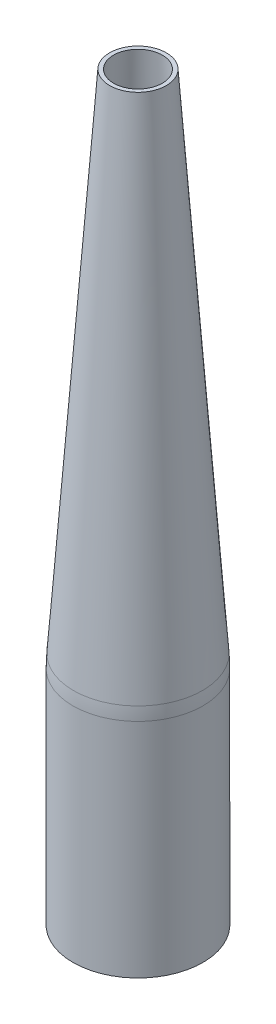
ISO-10303-21;
HEADER;
FILE_DESCRIPTION(('STEP AP214'),'2;1');
FILE_NAME('part.step','',(''),(''),'','','');
FILE_SCHEMA(('AUTOMOTIVE_DESIGN { 1 0 10303 214 1 1 1 1 }'));
ENDSEC;
DATA;
#1=APPLICATION_CONTEXT('core data for automotive mechanical design processes');
#2=APPLICATION_PROTOCOL_DEFINITION('international standard','automotive_design',2000,#1);
#3=PRODUCT_CONTEXT('',#1,'mechanical');
#4=PRODUCT('Part','Part','',(#3));
#5=PRODUCT_RELATED_PRODUCT_CATEGORY('part','',(#4));
#6=PRODUCT_DEFINITION_FORMATION('','',#4);
#7=PRODUCT_DEFINITION_CONTEXT('part definition',#1,'design');
#8=PRODUCT_DEFINITION('design','',#6,#7);
#9=PRODUCT_DEFINITION_SHAPE('','',#8);
#10=(LENGTH_UNIT() NAMED_UNIT(*) SI_UNIT(.MILLI.,.METRE.));
#11=(NAMED_UNIT(*) PLANE_ANGLE_UNIT() SI_UNIT($,.RADIAN.));
#12=(NAMED_UNIT(*) SI_UNIT($,.STERADIAN.) SOLID_ANGLE_UNIT());
#13=UNCERTAINTY_MEASURE_WITH_UNIT(LENGTH_MEASURE(1.E-05),#10,'distance_accuracy_value','');
#14=(GEOMETRIC_REPRESENTATION_CONTEXT(3) GLOBAL_UNCERTAINTY_ASSIGNED_CONTEXT((#13)) GLOBAL_UNIT_ASSIGNED_CONTEXT((#10,
#11,#12)) REPRESENTATION_CONTEXT('',''));
#15=CARTESIAN_POINT('',(0.,0.,0.));
#16=DIRECTION('',(0.,0.,1.));
#17=DIRECTION('',(1.,0.,0.));
#18=AXIS2_PLACEMENT_3D('',#15,#16,#17);
#19=CARTESIAN_POINT('',(0.,308.61,0.));
#20=DIRECTION('',(0.,1.,0.));
#21=DIRECTION('',(0.,0.,1.));
#22=AXIS2_PLACEMENT_3D('',#19,#20,#21);
#23=PLANE('',#22);
#24=CARTESIAN_POINT('',(0.,308.61,0.));
#25=DIRECTION('',(0.,1.,0.));
#26=DIRECTION('',(0.,0.,1.));
#27=AXIS2_PLACEMENT_3D('',#24,#25,#26);
#28=CIRCLE('',#27,10.1557936237559);
#29=CARTESIAN_POINT('',(0.,308.61,10.1557936237559));
#30=VERTEX_POINT('',#29);
#31=EDGE_CURVE('E74',#30,#30,#28,.T.);
#32=ORIENTED_EDGE('',*,*,#31,.F.);
#33=EDGE_LOOP('',(#32));
#34=FACE_BOUND('',#33,.T.);
#35=CARTESIAN_POINT('',(0.,308.61,0.));
#36=DIRECTION('',(0.,1.,0.));
#37=DIRECTION('',(0.,0.,1.));
#38=AXIS2_PLACEMENT_3D('',#35,#36,#37);
#39=CIRCLE('',#38,11.811);
#40=CARTESIAN_POINT('',(0.,308.61,11.811));
#41=VERTEX_POINT('',#40);
#42=EDGE_CURVE('E67',#41,#41,#39,.T.);
#43=ORIENTED_EDGE('',*,*,#42,.T.);
#44=EDGE_LOOP('',(#43));
#45=FACE_BOUND('',#44,.T.);
#46=ADVANCED_FACE('F47',(#34,#45),#23,.T.);
#47=CARTESIAN_POINT('',(0.,0.,0.));
#48=DIRECTION('',(0.,1.,0.));
#49=DIRECTION('',(0.,0.,1.));
#50=AXIS2_PLACEMENT_3D('',#47,#48,#49);
#51=PLANE('',#50);
#52=CARTESIAN_POINT('',(0.,0.,0.));
#53=DIRECTION('',(0.,1.,0.));
#54=DIRECTION('',(0.,0.,1.));
#55=AXIS2_PLACEMENT_3D('',#52,#53,#54);
#56=CIRCLE('',#55,25.4);
#57=CARTESIAN_POINT('',(0.,0.,25.4));
#58=VERTEX_POINT('',#57);
#59=EDGE_CURVE('E73',#58,#58,#56,.T.);
#60=ORIENTED_EDGE('',*,*,#59,.T.);
#61=EDGE_LOOP('',(#60));
#62=FACE_BOUND('',#61,.T.);
#63=CARTESIAN_POINT('',(0.,0.,0.));
#64=DIRECTION('',(0.,1.,0.));
#65=DIRECTION('',(0.,0.,1.));
#66=AXIS2_PLACEMENT_3D('',#63,#64,#65);
#67=CIRCLE('',#66,27.051);
#68=CARTESIAN_POINT('',(0.,0.,27.051));
#69=VERTEX_POINT('',#68);
#70=EDGE_CURVE('E61',#69,#69,#67,.T.);
#71=ORIENTED_EDGE('',*,*,#70,.F.);
#72=EDGE_LOOP('',(#71));
#73=FACE_BOUND('',#72,.T.);
#74=ADVANCED_FACE('F101',(#62,#73),#51,.F.);
#75=CARTESIAN_POINT('',(0.,473.964,0.));
#76=DIRECTION('',(0.,1.,0.));
#77=DIRECTION('',(0.,0.,1.));
#78=AXIS2_PLACEMENT_3D('',#75,#76,#77);
#79=CYLINDRICAL_SURFACE('',#78,27.051);
#80=CARTESIAN_POINT('',(0.,92.5320338114933,0.));
#81=DIRECTION('',(0.,-1.,0.));
#82=DIRECTION('',(0.,0.,-1.));
#83=AXIS2_PLACEMENT_3D('',#80,#81,#82);
#84=CIRCLE('',#83,27.051);
#85=CARTESIAN_POINT('',(0.,92.5320338114933,-27.051));
#86=VERTEX_POINT('',#85);
#87=EDGE_CURVE('E10',#86,#86,#84,.T.);
#88=ORIENTED_EDGE('',*,*,#87,.T.);
#89=EDGE_LOOP('',(#88));
#90=FACE_BOUND('',#89,.T.);
#91=ORIENTED_EDGE('',*,*,#70,.T.);
#92=EDGE_LOOP('',(#91));
#93=FACE_BOUND('',#92,.T.);
#94=ADVANCED_FACE('F106',(#90,#93),#79,.T.);
#95=CARTESIAN_POINT('',(0.,95.25,0.));
#96=DIRECTION('',(0.,-1.,0.));
#97=DIRECTION('',(0.,0.,-1.));
#98=AXIS2_PLACEMENT_3D('',#95,#96,#97);
#99=CONICAL_SURFACE('',#98,27.051,0.0713074647852903);
#100=CARTESIAN_POINT('',(0.,97.961059020572,0.));
#101=DIRECTION('',(0.,1.,0.));
#102=DIRECTION('',(0.,0.,1.));
#103=AXIS2_PLACEMENT_3D('',#100,#101,#102);
#104=CIRCLE('',#103,26.857352927102);
#105=CARTESIAN_POINT('',(0.,97.961059020572,26.857352927102));
#106=VERTEX_POINT('',#105);
#107=EDGE_CURVE('E55',#106,#106,#104,.T.);
#108=ORIENTED_EDGE('',*,*,#107,.T.);
#109=EDGE_LOOP('',(#108));
#110=FACE_BOUND('',#109,.T.);
#111=ORIENTED_EDGE('',*,*,#42,.F.);
#112=EDGE_LOOP('',(#111));
#113=FACE_BOUND('',#112,.T.);
#114=ADVANCED_FACE('F97',(#110,#113),#99,.T.);
#115=CARTESIAN_POINT('',(0.,473.964,0.));
#116=DIRECTION('',(0.,1.,0.));
#117=DIRECTION('',(0.,0.,1.));
#118=AXIS2_PLACEMENT_3D('',#115,#116,#117);
#119=CYLINDRICAL_SURFACE('',#118,25.4);
#120=CARTESIAN_POINT('',(0.,95.1911107325823,0.));
#121=DIRECTION('',(0.,-1.,0.));
#122=DIRECTION('',(0.,0.,-1.));
#123=AXIS2_PLACEMENT_3D('',#120,#121,#122);
#124=CIRCLE('',#123,25.4);
#125=CARTESIAN_POINT('',(0.,95.1911107325823,-25.4));
#126=VERTEX_POINT('',#125);
#127=EDGE_CURVE('E77',#126,#126,#124,.F.);
#128=ORIENTED_EDGE('',*,*,#127,.T.);
#129=EDGE_LOOP('',(#128));
#130=FACE_BOUND('',#129,.T.);
#131=ORIENTED_EDGE('',*,*,#59,.F.);
#132=EDGE_LOOP('',(#131));
#133=FACE_BOUND('',#132,.T.);
#134=ADVANCED_FACE('F84',(#130,#133),#119,.F.);
#135=CARTESIAN_POINT('',(0.,95.13237112047,0.));
#136=DIRECTION('',(0.,-1.,0.));
#137=DIRECTION('',(0.,0.,-1.));
#138=AXIS2_PLACEMENT_3D('',#135,#136,#137);
#139=CONICAL_SURFACE('',#138,25.4041956865795,0.0713074647852903);
#140=ORIENTED_EDGE('',*,*,#31,.T.);
#141=EDGE_LOOP('',(#140));
#142=FACE_BOUND('',#141,.T.);
#143=ORIENTED_EDGE('',*,*,#127,.F.);
#144=EDGE_LOOP('',(#143));
#145=FACE_BOUND('',#144,.T.);
#146=ADVANCED_FACE('F87',(#142,#145),#139,.F.);
#147=CARTESIAN_POINT('',(0.,92.5320338114933,0.));
#148=DIRECTION('',(0.,-1.,0.));
#149=DIRECTION('',(0.,0.,-1.));
#150=AXIS2_PLACEMENT_3D('',#147,#148,#149);
#151=DEGENERATE_TOROIDAL_SURFACE('',#150,49.149,76.2,.F.);
#152=ORIENTED_EDGE('',*,*,#87,.F.);
#153=EDGE_LOOP('',(#152));
#154=FACE_BOUND('',#153,.T.);
#155=ORIENTED_EDGE('',*,*,#107,.F.);
#156=EDGE_LOOP('',(#155));
#157=FACE_BOUND('',#156,.T.);
#158=ADVANCED_FACE('F49',(#154,#157),#151,.F.);
#159=CLOSED_SHELL('',(#46,#74,#94,#114,#134,#146,#158));
#160=MANIFOLD_SOLID_BREP('B2',#159);
#161=ADVANCED_BREP_SHAPE_REPRESENTATION('',(#18,#160),#14);
#162=SHAPE_DEFINITION_REPRESENTATION(#9,#161);
ENDSEC;
END-ISO-10303-21;
